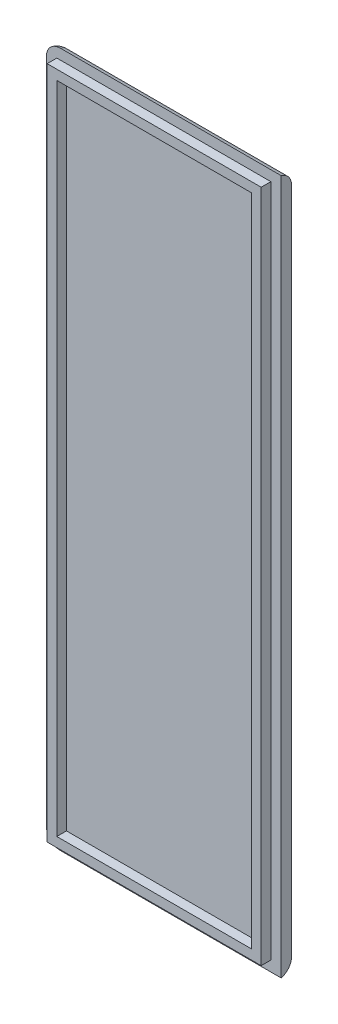
ISO-10303-21;
HEADER;
FILE_DESCRIPTION(('STEP AP214'),'2;1');
FILE_NAME('part.step','',(''),(''),'','','');
FILE_SCHEMA(('AUTOMOTIVE_DESIGN { 1 0 10303 214 1 1 1 1 }'));
ENDSEC;
DATA;
#1=APPLICATION_CONTEXT('core data for automotive mechanical design processes');
#2=APPLICATION_PROTOCOL_DEFINITION('international standard','automotive_design',2000,#1);
#3=PRODUCT_CONTEXT('',#1,'mechanical');
#4=PRODUCT('Part','Part','',(#3));
#5=PRODUCT_RELATED_PRODUCT_CATEGORY('part','',(#4));
#6=PRODUCT_DEFINITION_FORMATION('','',#4);
#7=PRODUCT_DEFINITION_CONTEXT('part definition',#1,'design');
#8=PRODUCT_DEFINITION('design','',#6,#7);
#9=PRODUCT_DEFINITION_SHAPE('','',#8);
#10=(LENGTH_UNIT() NAMED_UNIT(*) SI_UNIT(.MILLI.,.METRE.));
#11=(NAMED_UNIT(*) PLANE_ANGLE_UNIT() SI_UNIT($,.RADIAN.));
#12=(NAMED_UNIT(*) SI_UNIT($,.STERADIAN.) SOLID_ANGLE_UNIT());
#13=UNCERTAINTY_MEASURE_WITH_UNIT(LENGTH_MEASURE(1.E-05),#10,'distance_accuracy_value','');
#14=(GEOMETRIC_REPRESENTATION_CONTEXT(3) GLOBAL_UNCERTAINTY_ASSIGNED_CONTEXT((#13)) GLOBAL_UNIT_ASSIGNED_CONTEXT((#10,
#11,#12)) REPRESENTATION_CONTEXT('',''));
#15=CARTESIAN_POINT('',(0.,0.,0.));
#16=DIRECTION('',(0.,0.,1.));
#17=DIRECTION('',(1.,0.,0.));
#18=AXIS2_PLACEMENT_3D('',#15,#16,#17);
#19=CARTESIAN_POINT('',(0.,0.,1.5));
#20=DIRECTION('',(0.,0.,-1.));
#21=DIRECTION('',(-1.,0.,0.));
#22=AXIS2_PLACEMENT_3D('',#19,#20,#21);
#23=PLANE('',#22);
#24=DIRECTION('',(-1.,0.,0.));
#25=VECTOR('',#24,1.);
#26=CARTESIAN_POINT('',(0.,100.65,1.5));
#27=LINE('',#26,#25);
#28=CARTESIAN_POINT('',(34.,100.65,1.5));
#29=VERTEX_POINT('',#28);
#30=CARTESIAN_POINT('',(1.99999999999998,100.65,1.5));
#31=VERTEX_POINT('',#30);
#32=EDGE_CURVE('E219',#29,#31,#27,.T.);
#33=ORIENTED_EDGE('',*,*,#32,.T.);
#34=CARTESIAN_POINT('',(1.99999999999998,98.65,1.5));
#35=DIRECTION('',(0.,0.,-1.));
#36=DIRECTION('',(-1.,0.,0.));
#37=AXIS2_PLACEMENT_3D('',#34,#35,#36);
#38=CIRCLE('',#37,2.);
#39=CARTESIAN_POINT('',(0.,98.65,1.5));
#40=VERTEX_POINT('',#39);
#41=EDGE_CURVE('E226',#31,#40,#38,.F.);
#42=ORIENTED_EDGE('',*,*,#41,.T.);
#43=DIRECTION('',(0.,-1.,0.));
#44=VECTOR('',#43,1.);
#45=CARTESIAN_POINT('',(0.,0.,1.5));
#46=LINE('',#45,#44);
#47=CARTESIAN_POINT('',(0.,2.,1.5));
#48=VERTEX_POINT('',#47);
#49=EDGE_CURVE('E212',#40,#48,#46,.T.);
#50=ORIENTED_EDGE('',*,*,#49,.T.);
#51=CARTESIAN_POINT('',(2.,2.,1.5));
#52=DIRECTION('',(0.,0.,-1.));
#53=DIRECTION('',(-1.,0.,0.));
#54=AXIS2_PLACEMENT_3D('',#51,#52,#53);
#55=CIRCLE('',#54,2.);
#56=CARTESIAN_POINT('',(2.,0.,1.5));
#57=VERTEX_POINT('',#56);
#58=EDGE_CURVE('E222',#48,#57,#55,.F.);
#59=ORIENTED_EDGE('',*,*,#58,.T.);
#60=DIRECTION('',(1.,0.,0.));
#61=VECTOR('',#60,1.);
#62=CARTESIAN_POINT('',(0.,0.,1.5));
#63=LINE('',#62,#61);
#64=CARTESIAN_POINT('',(34.,0.,1.5));
#65=VERTEX_POINT('',#64);
#66=EDGE_CURVE('E214',#57,#65,#63,.T.);
#67=ORIENTED_EDGE('',*,*,#66,.T.);
#68=DIRECTION('',(0.,1.,0.));
#69=VECTOR('',#68,1.);
#70=CARTESIAN_POINT('',(34.,0.,1.5));
#71=LINE('',#70,#69);
#72=EDGE_CURVE('E216',#65,#29,#71,.T.);
#73=ORIENTED_EDGE('',*,*,#72,.T.);
#74=EDGE_LOOP('',(#33,#42,#50,#59,#67,#73));
#75=FACE_BOUND('',#74,.T.);
#76=DIRECTION('',(0.,-1.,0.));
#77=VECTOR('',#76,1.);
#78=CARTESIAN_POINT('',(1.49999999999998,99.15,1.5));
#79=LINE('',#78,#77);
#80=CARTESIAN_POINT('',(1.49999999999998,99.15,1.5));
#81=VERTEX_POINT('',#80);
#82=CARTESIAN_POINT('',(1.49999999999999,1.5,1.5));
#83=VERTEX_POINT('',#82);
#84=EDGE_CURVE('E155',#81,#83,#79,.T.);
#85=ORIENTED_EDGE('',*,*,#84,.F.);
#86=DIRECTION('',(-1.,0.,0.));
#87=VECTOR('',#86,1.);
#88=CARTESIAN_POINT('',(1.49999999999998,99.15,1.5));
#89=LINE('',#88,#87);
#90=CARTESIAN_POINT('',(32.5,99.15,1.5));
#91=VERTEX_POINT('',#90);
#92=EDGE_CURVE('E183',#91,#81,#89,.T.);
#93=ORIENTED_EDGE('',*,*,#92,.F.);
#94=DIRECTION('',(0.,1.,0.));
#95=VECTOR('',#94,1.);
#96=CARTESIAN_POINT('',(32.5,99.15,1.5));
#97=LINE('',#96,#95);
#98=CARTESIAN_POINT('',(32.5,1.5,1.5));
#99=VERTEX_POINT('',#98);
#100=EDGE_CURVE('E195',#99,#91,#97,.T.);
#101=ORIENTED_EDGE('',*,*,#100,.F.);
#102=DIRECTION('',(1.,0.,0.));
#103=VECTOR('',#102,1.);
#104=CARTESIAN_POINT('',(1.49999999999999,1.5,1.5));
#105=LINE('',#104,#103);
#106=EDGE_CURVE('E192',#83,#99,#105,.T.);
#107=ORIENTED_EDGE('',*,*,#106,.F.);
#108=EDGE_LOOP('',(#85,#93,#101,#107));
#109=FACE_BOUND('',#108,.T.);
#110=ADVANCED_FACE('F35',(#75,#109),#23,.F.);
#111=CARTESIAN_POINT('',(34.,0.,1.5));
#112=DIRECTION('',(-1.,0.,0.));
#113=DIRECTION('',(0.,-1.,0.));
#114=AXIS2_PLACEMENT_3D('',#111,#112,#113);
#115=PLANE('',#114);
#116=DIRECTION('',(0.,1.,0.));
#117=VECTOR('',#116,1.);
#118=CARTESIAN_POINT('',(34.,0.,0.));
#119=LINE('',#118,#117);
#120=CARTESIAN_POINT('',(34.,1.93649167310371,0.));
#121=VERTEX_POINT('',#120);
#122=CARTESIAN_POINT('',(34.,98.7135083268963,0.));
#123=VERTEX_POINT('',#122);
#124=EDGE_CURVE('E211',#121,#123,#119,.T.);
#125=ORIENTED_EDGE('',*,*,#124,.T.);
#126=CARTESIAN_POINT('',(34.,98.7135083268963,2.));
#127=DIRECTION('',(-1.,0.,0.));
#128=DIRECTION('',(0.,-1.,0.));
#129=AXIS2_PLACEMENT_3D('',#126,#127,#128);
#130=CIRCLE('',#129,2.);
#131=EDGE_CURVE('E11',#123,#29,#130,.F.);
#132=ORIENTED_EDGE('',*,*,#131,.T.);
#133=ORIENTED_EDGE('',*,*,#72,.F.);
#134=CARTESIAN_POINT('',(34.,1.93649167310371,2.));
#135=DIRECTION('',(-1.,0.,0.));
#136=DIRECTION('',(0.,-1.,0.));
#137=AXIS2_PLACEMENT_3D('',#134,#135,#136);
#138=CIRCLE('',#137,2.);
#139=EDGE_CURVE('E44',#65,#121,#138,.F.);
#140=ORIENTED_EDGE('',*,*,#139,.T.);
#141=EDGE_LOOP('',(#125,#132,#133,#140));
#142=FACE_BOUND('',#141,.T.);
#143=ADVANCED_FACE('F261',(#142),#115,.F.);
#144=CARTESIAN_POINT('',(0.,0.,0.));
#145=DIRECTION('',(0.,0.,-1.));
#146=DIRECTION('',(-1.,0.,0.));
#147=AXIS2_PLACEMENT_3D('',#144,#145,#146);
#148=PLANE('',#147);
#149=CARTESIAN_POINT('',(1.99999999999998,98.65,0.));
#150=DIRECTION('',(0.,0.,-1.));
#151=DIRECTION('',(-1.,0.,0.));
#152=AXIS2_PLACEMENT_3D('',#149,#150,#151);
#153=CIRCLE('',#152,0.0635083268962916);
#154=CARTESIAN_POINT('',(1.93649167310369,98.65,0.));
#155=VERTEX_POINT('',#154);
#156=CARTESIAN_POINT('',(1.99999999999998,98.7135083268963,0.));
#157=VERTEX_POINT('',#156);
#158=EDGE_CURVE('E52',#155,#157,#153,.T.);
#159=ORIENTED_EDGE('',*,*,#158,.T.);
#160=DIRECTION('',(-1.,0.,0.));
#161=VECTOR('',#160,1.);
#162=CARTESIAN_POINT('',(34.,98.7135083268963,0.));
#163=LINE('',#162,#161);
#164=EDGE_CURVE('E234',#157,#123,#163,.F.);
#165=ORIENTED_EDGE('',*,*,#164,.T.);
#166=ORIENTED_EDGE('',*,*,#124,.F.);
#167=DIRECTION('',(1.,0.,0.));
#168=VECTOR('',#167,1.);
#169=CARTESIAN_POINT('',(2.,1.93649167310371,0.));
#170=LINE('',#169,#168);
#171=CARTESIAN_POINT('',(2.,1.93649167310371,0.));
#172=VERTEX_POINT('',#171);
#173=EDGE_CURVE('E228',#121,#172,#170,.F.);
#174=ORIENTED_EDGE('',*,*,#173,.T.);
#175=CARTESIAN_POINT('',(2.,2.,0.));
#176=DIRECTION('',(0.,0.,-1.));
#177=DIRECTION('',(-1.,0.,0.));
#178=AXIS2_PLACEMENT_3D('',#175,#176,#177);
#179=CIRCLE('',#178,0.0635083268962916);
#180=CARTESIAN_POINT('',(1.93649167310371,2.,0.));
#181=VERTEX_POINT('',#180);
#182=EDGE_CURVE('E230',#172,#181,#179,.T.);
#183=ORIENTED_EDGE('',*,*,#182,.T.);
#184=DIRECTION('',(0.,-1.,0.));
#185=VECTOR('',#184,1.);
#186=CARTESIAN_POINT('',(1.93649167310369,98.65,0.));
#187=LINE('',#186,#185);
#188=EDGE_CURVE('E57',#181,#155,#187,.F.);
#189=ORIENTED_EDGE('',*,*,#188,.T.);
#190=EDGE_LOOP('',(#159,#165,#166,#174,#183,#189));
#191=FACE_BOUND('',#190,.T.);
#192=ADVANCED_FACE('F285',(#191),#148,.T.);
#193=CARTESIAN_POINT('',(0.,0.,2.9));
#194=DIRECTION('',(0.,0.,1.));
#195=DIRECTION('',(1.,0.,0.));
#196=AXIS2_PLACEMENT_3D('',#193,#194,#195);
#197=PLANE('',#196);
#198=DIRECTION('',(0.,-1.,0.));
#199=VECTOR('',#198,1.);
#200=CARTESIAN_POINT('',(1.49999999999998,99.15,2.9));
#201=LINE('',#200,#199);
#202=CARTESIAN_POINT('',(1.49999999999998,99.15,2.9));
#203=VERTEX_POINT('',#202);
#204=CARTESIAN_POINT('',(1.49999999999999,1.5,2.9));
#205=VERTEX_POINT('',#204);
#206=EDGE_CURVE('E179',#203,#205,#201,.T.);
#207=ORIENTED_EDGE('',*,*,#206,.T.);
#208=DIRECTION('',(1.,0.,0.));
#209=VECTOR('',#208,1.);
#210=CARTESIAN_POINT('',(1.49999999999999,1.5,2.9));
#211=LINE('',#210,#209);
#212=CARTESIAN_POINT('',(32.5,1.5,2.9));
#213=VERTEX_POINT('',#212);
#214=EDGE_CURVE('E182',#205,#213,#211,.T.);
#215=ORIENTED_EDGE('',*,*,#214,.T.);
#216=DIRECTION('',(0.,1.,0.));
#217=VECTOR('',#216,1.);
#218=CARTESIAN_POINT('',(32.5,99.15,2.9));
#219=LINE('',#218,#217);
#220=CARTESIAN_POINT('',(32.5,99.15,2.9));
#221=VERTEX_POINT('',#220);
#222=EDGE_CURVE('E185',#213,#221,#219,.T.);
#223=ORIENTED_EDGE('',*,*,#222,.T.);
#224=DIRECTION('',(-1.,0.,0.));
#225=VECTOR('',#224,1.);
#226=CARTESIAN_POINT('',(1.49999999999998,99.15,2.9));
#227=LINE('',#226,#225);
#228=EDGE_CURVE('E187',#221,#203,#227,.T.);
#229=ORIENTED_EDGE('',*,*,#228,.T.);
#230=EDGE_LOOP('',(#207,#215,#223,#229));
#231=FACE_BOUND('',#230,.T.);
#232=DIRECTION('',(1.,0.,0.));
#233=VECTOR('',#232,1.);
#234=CARTESIAN_POINT('',(2.89999999999999,2.9,2.9));
#235=LINE('',#234,#233);
#236=CARTESIAN_POINT('',(2.89999999999999,2.9,2.9));
#237=VERTEX_POINT('',#236);
#238=CARTESIAN_POINT('',(31.1,2.9,2.9));
#239=VERTEX_POINT('',#238);
#240=EDGE_CURVE('E147',#237,#239,#235,.T.);
#241=ORIENTED_EDGE('',*,*,#240,.F.);
#242=DIRECTION('',(0.,-1.,0.));
#243=VECTOR('',#242,1.);
#244=CARTESIAN_POINT('',(2.89999999999998,97.75,2.9));
#245=LINE('',#244,#243);
#246=CARTESIAN_POINT('',(2.89999999999998,97.75,2.9));
#247=VERTEX_POINT('',#246);
#248=EDGE_CURVE('E137',#247,#237,#245,.T.);
#249=ORIENTED_EDGE('',*,*,#248,.F.);
#250=DIRECTION('',(-1.,0.,0.));
#251=VECTOR('',#250,1.);
#252=CARTESIAN_POINT('',(2.89999999999998,97.75,2.9));
#253=LINE('',#252,#251);
#254=CARTESIAN_POINT('',(31.1,97.75,2.9));
#255=VERTEX_POINT('',#254);
#256=EDGE_CURVE('E163',#255,#247,#253,.T.);
#257=ORIENTED_EDGE('',*,*,#256,.F.);
#258=DIRECTION('',(0.,1.,0.));
#259=VECTOR('',#258,1.);
#260=CARTESIAN_POINT('',(31.1,97.75,2.9));
#261=LINE('',#260,#259);
#262=EDGE_CURVE('E161',#239,#255,#261,.T.);
#263=ORIENTED_EDGE('',*,*,#262,.F.);
#264=EDGE_LOOP('',(#241,#249,#257,#263));
#265=FACE_BOUND('',#264,.T.);
#266=ADVANCED_FACE('F159',(#231,#265),#197,.T.);
#267=CARTESIAN_POINT('',(1.49999999999998,99.15,2.9));
#268=DIRECTION('',(1.,0.,0.));
#269=DIRECTION('',(0.,1.,0.));
#270=AXIS2_PLACEMENT_3D('',#267,#268,#269);
#271=PLANE('',#270);
#272=ORIENTED_EDGE('',*,*,#84,.T.);
#273=DIRECTION('',(0.,0.,-1.));
#274=VECTOR('',#273,1.);
#275=CARTESIAN_POINT('',(1.49999999999999,1.5,2.9));
#276=LINE('',#275,#274);
#277=EDGE_CURVE('E208',#205,#83,#276,.T.);
#278=ORIENTED_EDGE('',*,*,#277,.F.);
#279=ORIENTED_EDGE('',*,*,#206,.F.);
#280=DIRECTION('',(0.,0.,-1.));
#281=VECTOR('',#280,1.);
#282=CARTESIAN_POINT('',(1.49999999999998,99.15,2.9));
#283=LINE('',#282,#281);
#284=EDGE_CURVE('E189',#203,#81,#283,.T.);
#285=ORIENTED_EDGE('',*,*,#284,.T.);
#286=EDGE_LOOP('',(#272,#278,#279,#285));
#287=FACE_BOUND('',#286,.T.);
#288=ADVANCED_FACE('F314',(#287),#271,.F.);
#289=CARTESIAN_POINT('',(1.49999999999999,1.5,2.9));
#290=DIRECTION('',(0.,1.,0.));
#291=DIRECTION('',(0.,0.,1.));
#292=AXIS2_PLACEMENT_3D('',#289,#290,#291);
#293=PLANE('',#292);
#294=ORIENTED_EDGE('',*,*,#106,.T.);
#295=DIRECTION('',(0.,0.,-1.));
#296=VECTOR('',#295,1.);
#297=CARTESIAN_POINT('',(32.5,1.5,2.9));
#298=LINE('',#297,#296);
#299=EDGE_CURVE('E205',#213,#99,#298,.T.);
#300=ORIENTED_EDGE('',*,*,#299,.F.);
#301=ORIENTED_EDGE('',*,*,#214,.F.);
#302=ORIENTED_EDGE('',*,*,#277,.T.);
#303=EDGE_LOOP('',(#294,#300,#301,#302));
#304=FACE_BOUND('',#303,.T.);
#305=ADVANCED_FACE('F322',(#304),#293,.F.);
#306=CARTESIAN_POINT('',(32.5,99.15,2.9));
#307=DIRECTION('',(-1.,0.,0.));
#308=DIRECTION('',(0.,-1.,0.));
#309=AXIS2_PLACEMENT_3D('',#306,#307,#308);
#310=PLANE('',#309);
#311=ORIENTED_EDGE('',*,*,#100,.T.);
#312=DIRECTION('',(0.,0.,-1.));
#313=VECTOR('',#312,1.);
#314=CARTESIAN_POINT('',(32.5,99.15,2.9));
#315=LINE('',#314,#313);
#316=EDGE_CURVE('E202',#221,#91,#315,.T.);
#317=ORIENTED_EDGE('',*,*,#316,.F.);
#318=ORIENTED_EDGE('',*,*,#222,.F.);
#319=ORIENTED_EDGE('',*,*,#299,.T.);
#320=EDGE_LOOP('',(#311,#317,#318,#319));
#321=FACE_BOUND('',#320,.T.);
#322=ADVANCED_FACE('F318',(#321),#310,.F.);
#323=CARTESIAN_POINT('',(1.49999999999998,99.15,2.9));
#324=DIRECTION('',(0.,-1.,0.));
#325=DIRECTION('',(0.,0.,-1.));
#326=AXIS2_PLACEMENT_3D('',#323,#324,#325);
#327=PLANE('',#326);
#328=ORIENTED_EDGE('',*,*,#92,.T.);
#329=ORIENTED_EDGE('',*,*,#284,.F.);
#330=ORIENTED_EDGE('',*,*,#228,.F.);
#331=ORIENTED_EDGE('',*,*,#316,.T.);
#332=EDGE_LOOP('',(#328,#329,#330,#331));
#333=FACE_BOUND('',#332,.T.);
#334=ADVANCED_FACE('F311',(#333),#327,.F.);
#335=CARTESIAN_POINT('',(2.89999999999998,97.75,2.9));
#336=DIRECTION('',(1.,0.,0.));
#337=DIRECTION('',(0.,1.,0.));
#338=AXIS2_PLACEMENT_3D('',#335,#336,#337);
#339=PLANE('',#338);
#340=DIRECTION('',(0.,-1.,0.));
#341=VECTOR('',#340,1.);
#342=CARTESIAN_POINT('',(2.89999999999998,97.75,1.5));
#343=LINE('',#342,#341);
#344=CARTESIAN_POINT('',(2.89999999999998,97.75,1.5));
#345=VERTEX_POINT('',#344);
#346=CARTESIAN_POINT('',(2.89999999999999,2.9,1.5));
#347=VERTEX_POINT('',#346);
#348=EDGE_CURVE('E167',#345,#347,#343,.T.);
#349=ORIENTED_EDGE('',*,*,#348,.F.);
#350=DIRECTION('',(0.,0.,-1.));
#351=VECTOR('',#350,1.);
#352=CARTESIAN_POINT('',(2.89999999999998,97.75,2.9));
#353=LINE('',#352,#351);
#354=EDGE_CURVE('E143',#247,#345,#353,.T.);
#355=ORIENTED_EDGE('',*,*,#354,.F.);
#356=ORIENTED_EDGE('',*,*,#248,.T.);
#357=DIRECTION('',(0.,0.,-1.));
#358=VECTOR('',#357,1.);
#359=CARTESIAN_POINT('',(2.89999999999999,2.9,2.9));
#360=LINE('',#359,#358);
#361=EDGE_CURVE('E141',#237,#347,#360,.T.);
#362=ORIENTED_EDGE('',*,*,#361,.T.);
#363=EDGE_LOOP('',(#349,#355,#356,#362));
#364=FACE_BOUND('',#363,.T.);
#365=ADVANCED_FACE('F140',(#364),#339,.T.);
#366=CARTESIAN_POINT('',(2.89999999999999,2.9,2.9));
#367=DIRECTION('',(0.,1.,0.));
#368=DIRECTION('',(0.,0.,1.));
#369=AXIS2_PLACEMENT_3D('',#366,#367,#368);
#370=PLANE('',#369);
#371=DIRECTION('',(1.,0.,0.));
#372=VECTOR('',#371,1.);
#373=CARTESIAN_POINT('',(2.89999999999999,2.9,1.5));
#374=LINE('',#373,#372);
#375=CARTESIAN_POINT('',(31.1,2.9,1.5));
#376=VERTEX_POINT('',#375);
#377=EDGE_CURVE('E154',#347,#376,#374,.T.);
#378=ORIENTED_EDGE('',*,*,#377,.F.);
#379=ORIENTED_EDGE('',*,*,#361,.F.);
#380=ORIENTED_EDGE('',*,*,#240,.T.);
#381=DIRECTION('',(0.,0.,-1.));
#382=VECTOR('',#381,1.);
#383=CARTESIAN_POINT('',(31.1,2.9,2.9));
#384=LINE('',#383,#382);
#385=EDGE_CURVE('E156',#239,#376,#384,.T.);
#386=ORIENTED_EDGE('',*,*,#385,.T.);
#387=EDGE_LOOP('',(#378,#379,#380,#386));
#388=FACE_BOUND('',#387,.T.);
#389=ADVANCED_FACE('F151',(#388),#370,.T.);
#390=CARTESIAN_POINT('',(31.1,97.75,2.9));
#391=DIRECTION('',(-1.,0.,0.));
#392=DIRECTION('',(0.,-1.,0.));
#393=AXIS2_PLACEMENT_3D('',#390,#391,#392);
#394=PLANE('',#393);
#395=DIRECTION('',(0.,1.,0.));
#396=VECTOR('',#395,1.);
#397=CARTESIAN_POINT('',(31.1,97.75,1.5));
#398=LINE('',#397,#396);
#399=CARTESIAN_POINT('',(31.1,97.75,1.5));
#400=VERTEX_POINT('',#399);
#401=EDGE_CURVE('E170',#376,#400,#398,.T.);
#402=ORIENTED_EDGE('',*,*,#401,.F.);
#403=ORIENTED_EDGE('',*,*,#385,.F.);
#404=ORIENTED_EDGE('',*,*,#262,.T.);
#405=DIRECTION('',(0.,0.,-1.));
#406=VECTOR('',#405,1.);
#407=CARTESIAN_POINT('',(31.1,97.75,2.9));
#408=LINE('',#407,#406);
#409=EDGE_CURVE('E176',#255,#400,#408,.T.);
#410=ORIENTED_EDGE('',*,*,#409,.T.);
#411=EDGE_LOOP('',(#402,#403,#404,#410));
#412=FACE_BOUND('',#411,.T.);
#413=ADVANCED_FACE('F296',(#412),#394,.T.);
#414=CARTESIAN_POINT('',(2.89999999999998,97.75,2.9));
#415=DIRECTION('',(0.,-1.,0.));
#416=DIRECTION('',(0.,0.,-1.));
#417=AXIS2_PLACEMENT_3D('',#414,#415,#416);
#418=PLANE('',#417);
#419=DIRECTION('',(-1.,0.,0.));
#420=VECTOR('',#419,1.);
#421=CARTESIAN_POINT('',(2.89999999999998,97.75,1.5));
#422=LINE('',#421,#420);
#423=EDGE_CURVE('E148',#400,#345,#422,.T.);
#424=ORIENTED_EDGE('',*,*,#423,.F.);
#425=ORIENTED_EDGE('',*,*,#409,.F.);
#426=ORIENTED_EDGE('',*,*,#256,.T.);
#427=ORIENTED_EDGE('',*,*,#354,.T.);
#428=EDGE_LOOP('',(#424,#425,#426,#427));
#429=FACE_BOUND('',#428,.T.);
#430=ADVANCED_FACE('F290',(#429),#418,.T.);
#431=ORIENTED_EDGE('',*,*,#423,.T.);
#432=ORIENTED_EDGE('',*,*,#348,.T.);
#433=ORIENTED_EDGE('',*,*,#377,.T.);
#434=ORIENTED_EDGE('',*,*,#401,.T.);
#435=EDGE_LOOP('',(#431,#432,#433,#434));
#436=FACE_BOUND('',#435,.T.);
#437=ADVANCED_FACE('F281',(#436),#23,.F.);
#438=CARTESIAN_POINT('',(0.,1.93649167310371,2.));
#439=DIRECTION('',(-1.,0.,0.));
#440=DIRECTION('',(0.,0.,1.));
#441=AXIS2_PLACEMENT_3D('',#438,#439,#440);
#442=CYLINDRICAL_SURFACE('',#441,2.);
#443=ORIENTED_EDGE('',*,*,#139,.F.);
#444=ORIENTED_EDGE('',*,*,#66,.F.);
#445=CARTESIAN_POINT('',(2.,1.93649167310371,2.));
#446=DIRECTION('',(-1.,0.,0.));
#447=DIRECTION('',(0.,0.,1.));
#448=AXIS2_PLACEMENT_3D('',#445,#446,#447);
#449=CIRCLE('',#448,2.);
#450=EDGE_CURVE('E39',#172,#57,#449,.T.);
#451=ORIENTED_EDGE('',*,*,#450,.F.);
#452=ORIENTED_EDGE('',*,*,#173,.F.);
#453=EDGE_LOOP('',(#443,#444,#451,#452));
#454=FACE_BOUND('',#453,.T.);
#455=ADVANCED_FACE('F37',(#454),#442,.T.);
#456=CARTESIAN_POINT('',(2.,2.,2.));
#457=DIRECTION('',(0.,0.,1.));
#458=DIRECTION('',(1.,0.,0.));
#459=AXIS2_PLACEMENT_3D('',#456,#457,#458);
#460=DEGENERATE_TOROIDAL_SURFACE('',#459,0.0635083268962916,2.,.T.);
#461=ORIENTED_EDGE('',*,*,#450,.T.);
#462=ORIENTED_EDGE('',*,*,#58,.F.);
#463=CARTESIAN_POINT('',(1.93649167310371,2.,2.));
#464=DIRECTION('',(0.,1.,0.));
#465=DIRECTION('',(-1.,0.,0.));
#466=AXIS2_PLACEMENT_3D('',#463,#464,#465);
#467=CIRCLE('',#466,2.);
#468=EDGE_CURVE('E241',#181,#48,#467,.T.);
#469=ORIENTED_EDGE('',*,*,#468,.F.);
#470=ORIENTED_EDGE('',*,*,#182,.F.);
#471=EDGE_LOOP('',(#461,#462,#469,#470));
#472=FACE_BOUND('',#471,.T.);
#473=ADVANCED_FACE('F251',(#472),#460,.T.);
#474=CARTESIAN_POINT('',(1.93649167310371,0.,2.));
#475=DIRECTION('',(0.,1.,0.));
#476=DIRECTION('',(-1.,0.,0.));
#477=AXIS2_PLACEMENT_3D('',#474,#475,#476);
#478=CYLINDRICAL_SURFACE('',#477,2.);
#479=ORIENTED_EDGE('',*,*,#468,.T.);
#480=ORIENTED_EDGE('',*,*,#49,.F.);
#481=CARTESIAN_POINT('',(1.93649167310369,98.65,2.));
#482=DIRECTION('',(0.,1.,0.));
#483=DIRECTION('',(0.,0.,1.));
#484=AXIS2_PLACEMENT_3D('',#481,#482,#483);
#485=CIRCLE('',#484,2.);
#486=EDGE_CURVE('E239',#155,#40,#485,.T.);
#487=ORIENTED_EDGE('',*,*,#486,.F.);
#488=ORIENTED_EDGE('',*,*,#188,.F.);
#489=EDGE_LOOP('',(#479,#480,#487,#488));
#490=FACE_BOUND('',#489,.T.);
#491=ADVANCED_FACE('F269',(#490),#478,.T.);
#492=CARTESIAN_POINT('',(1.99999999999998,98.65,2.));
#493=DIRECTION('',(0.,0.,1.));
#494=DIRECTION('',(1.,0.,0.));
#495=AXIS2_PLACEMENT_3D('',#492,#493,#494);
#496=DEGENERATE_TOROIDAL_SURFACE('',#495,0.0635083268962916,2.,.T.);
#497=ORIENTED_EDGE('',*,*,#486,.T.);
#498=ORIENTED_EDGE('',*,*,#41,.F.);
#499=CARTESIAN_POINT('',(1.99999999999998,98.7135083268963,2.));
#500=DIRECTION('',(1.,0.,0.));
#501=DIRECTION('',(0.,0.,-1.));
#502=AXIS2_PLACEMENT_3D('',#499,#500,#501);
#503=CIRCLE('',#502,2.);
#504=EDGE_CURVE('E237',#157,#31,#503,.T.);
#505=ORIENTED_EDGE('',*,*,#504,.F.);
#506=ORIENTED_EDGE('',*,*,#158,.F.);
#507=EDGE_LOOP('',(#497,#498,#505,#506));
#508=FACE_BOUND('',#507,.T.);
#509=ADVANCED_FACE('F270',(#508),#496,.T.);
#510=CARTESIAN_POINT('',(0.,98.7135083268963,2.));
#511=DIRECTION('',(1.,0.,0.));
#512=DIRECTION('',(0.,0.,-1.));
#513=AXIS2_PLACEMENT_3D('',#510,#511,#512);
#514=CYLINDRICAL_SURFACE('',#513,2.);
#515=ORIENTED_EDGE('',*,*,#131,.F.);
#516=ORIENTED_EDGE('',*,*,#164,.F.);
#517=ORIENTED_EDGE('',*,*,#504,.T.);
#518=ORIENTED_EDGE('',*,*,#32,.F.);
#519=EDGE_LOOP('',(#515,#516,#517,#518));
#520=FACE_BOUND('',#519,.T.);
#521=ADVANCED_FACE('F265',(#520),#514,.T.);
#522=CLOSED_SHELL('',(#110,#143,#192,#266,#288,#305,#322,#334,#365,#389,#413,#430,#437,#455,
#473,#491,#509,#521));
#523=MANIFOLD_SOLID_BREP('B2',#522);
#524=ADVANCED_BREP_SHAPE_REPRESENTATION('',(#18,#523),#14);
#525=SHAPE_DEFINITION_REPRESENTATION(#9,#524);
ENDSEC;
END-ISO-10303-21;
